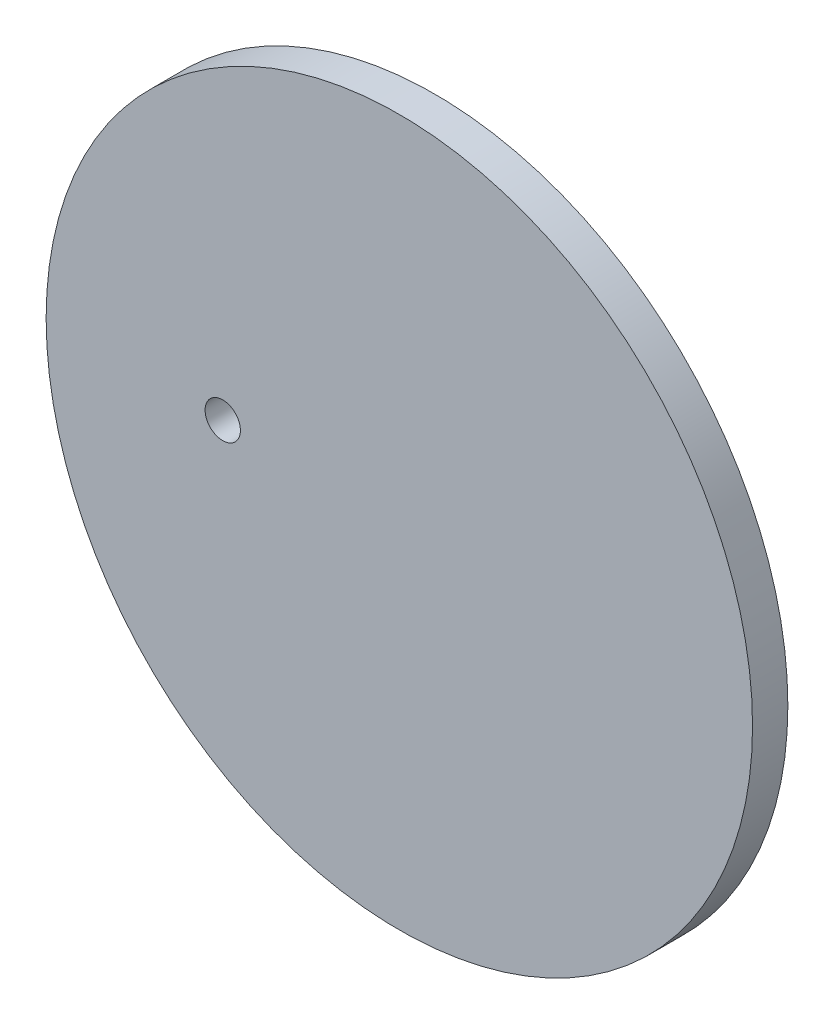
ISO-10303-21;
HEADER;
FILE_DESCRIPTION(('STEP AP214'),'2;1');
FILE_NAME('part.step','',(''),(''),'','','');
FILE_SCHEMA(('AUTOMOTIVE_DESIGN { 1 0 10303 214 1 1 1 1 }'));
ENDSEC;
DATA;
#1=APPLICATION_CONTEXT('core data for automotive mechanical design processes');
#2=APPLICATION_PROTOCOL_DEFINITION('international standard','automotive_design',2000,#1);
#3=PRODUCT_CONTEXT('',#1,'mechanical');
#4=PRODUCT('Part','Part','',(#3));
#5=PRODUCT_RELATED_PRODUCT_CATEGORY('part','',(#4));
#6=PRODUCT_DEFINITION_FORMATION('','',#4);
#7=PRODUCT_DEFINITION_CONTEXT('part definition',#1,'design');
#8=PRODUCT_DEFINITION('design','',#6,#7);
#9=PRODUCT_DEFINITION_SHAPE('','',#8);
#10=(LENGTH_UNIT() NAMED_UNIT(*) SI_UNIT(.MILLI.,.METRE.));
#11=(NAMED_UNIT(*) PLANE_ANGLE_UNIT() SI_UNIT($,.RADIAN.));
#12=(NAMED_UNIT(*) SI_UNIT($,.STERADIAN.) SOLID_ANGLE_UNIT());
#13=UNCERTAINTY_MEASURE_WITH_UNIT(LENGTH_MEASURE(1.E-05),#10,'distance_accuracy_value','');
#14=(GEOMETRIC_REPRESENTATION_CONTEXT(3) GLOBAL_UNCERTAINTY_ASSIGNED_CONTEXT((#13)) GLOBAL_UNIT_ASSIGNED_CONTEXT((#10,
#11,#12)) REPRESENTATION_CONTEXT('',''));
#15=CARTESIAN_POINT('',(0.,0.,0.));
#16=DIRECTION('',(0.,0.,1.));
#17=DIRECTION('',(1.,0.,0.));
#18=AXIS2_PLACEMENT_3D('',#15,#16,#17);
#19=CARTESIAN_POINT('',(0.,0.,2.));
#20=DIRECTION('',(0.,0.,1.));
#21=DIRECTION('',(1.,0.,0.));
#22=AXIS2_PLACEMENT_3D('',#19,#20,#21);
#23=PLANE('',#22);
#24=CARTESIAN_POINT('',(0.,0.,2.));
#25=DIRECTION('',(0.,0.,1.));
#26=DIRECTION('',(1.,0.,0.));
#27=AXIS2_PLACEMENT_3D('',#24,#25,#26);
#28=CIRCLE('',#27,40.);
#29=CARTESIAN_POINT('',(40.,0.,2.));
#30=VERTEX_POINT('',#29);
#31=EDGE_CURVE('E10',#30,#30,#28,.T.);
#32=ORIENTED_EDGE('',*,*,#31,.T.);
#33=EDGE_LOOP('',(#32));
#34=FACE_BOUND('',#33,.T.);
#35=CARTESIAN_POINT('',(-20.,0.,2.));
#36=DIRECTION('',(0.,0.,1.));
#37=DIRECTION('',(1.,0.,0.));
#38=AXIS2_PLACEMENT_3D('',#35,#36,#37);
#39=CIRCLE('',#38,2.);
#40=CARTESIAN_POINT('',(-18.,0.,2.));
#41=VERTEX_POINT('',#40);
#42=EDGE_CURVE('E40',#41,#41,#39,.T.);
#43=ORIENTED_EDGE('',*,*,#42,.F.);
#44=EDGE_LOOP('',(#43));
#45=FACE_BOUND('',#44,.T.);
#46=ADVANCED_FACE('F29',(#34,#45),#23,.T.);
#47=CARTESIAN_POINT('',(0.,0.,-2.));
#48=DIRECTION('',(0.,0.,1.));
#49=DIRECTION('',(1.,0.,0.));
#50=AXIS2_PLACEMENT_3D('',#47,#48,#49);
#51=PLANE('',#50);
#52=CARTESIAN_POINT('',(0.,0.,-2.));
#53=DIRECTION('',(0.,0.,1.));
#54=DIRECTION('',(1.,0.,0.));
#55=AXIS2_PLACEMENT_3D('',#52,#53,#54);
#56=CIRCLE('',#55,40.);
#57=CARTESIAN_POINT('',(40.,0.,-2.));
#58=VERTEX_POINT('',#57);
#59=EDGE_CURVE('E33',#58,#58,#56,.T.);
#60=ORIENTED_EDGE('',*,*,#59,.F.);
#61=EDGE_LOOP('',(#60));
#62=FACE_BOUND('',#61,.T.);
#63=CARTESIAN_POINT('',(-20.,0.,-2.));
#64=DIRECTION('',(0.,0.,1.));
#65=DIRECTION('',(1.,0.,0.));
#66=AXIS2_PLACEMENT_3D('',#63,#64,#65);
#67=CIRCLE('',#66,2.);
#68=CARTESIAN_POINT('',(-18.,0.,-2.));
#69=VERTEX_POINT('',#68);
#70=EDGE_CURVE('E42',#69,#69,#67,.T.);
#71=ORIENTED_EDGE('',*,*,#70,.T.);
#72=EDGE_LOOP('',(#71));
#73=FACE_BOUND('',#72,.T.);
#74=ADVANCED_FACE('F52',(#62,#73),#51,.F.);
#75=CARTESIAN_POINT('',(0.,0.,2.));
#76=DIRECTION('',(0.,0.,-1.));
#77=DIRECTION('',(-1.,0.,0.));
#78=AXIS2_PLACEMENT_3D('',#75,#76,#77);
#79=CYLINDRICAL_SURFACE('',#78,40.);
#80=ORIENTED_EDGE('',*,*,#31,.F.);
#81=EDGE_LOOP('',(#80));
#82=FACE_BOUND('',#81,.T.);
#83=ORIENTED_EDGE('',*,*,#59,.T.);
#84=EDGE_LOOP('',(#83));
#85=FACE_BOUND('',#84,.T.);
#86=ADVANCED_FACE('F31',(#82,#85),#79,.T.);
#87=CARTESIAN_POINT('',(-20.,0.,2.));
#88=DIRECTION('',(0.,0.,-1.));
#89=DIRECTION('',(-1.,0.,0.));
#90=AXIS2_PLACEMENT_3D('',#87,#88,#89);
#91=CYLINDRICAL_SURFACE('',#90,2.);
#92=ORIENTED_EDGE('',*,*,#42,.T.);
#93=EDGE_LOOP('',(#92));
#94=FACE_BOUND('',#93,.T.);
#95=ORIENTED_EDGE('',*,*,#70,.F.);
#96=EDGE_LOOP('',(#95));
#97=FACE_BOUND('',#96,.T.);
#98=ADVANCED_FACE('F48',(#94,#97),#91,.F.);
#99=CLOSED_SHELL('',(#46,#74,#86,#98));
#100=MANIFOLD_SOLID_BREP('B2',#99);
#101=ADVANCED_BREP_SHAPE_REPRESENTATION('',(#18,#100),#14);
#102=SHAPE_DEFINITION_REPRESENTATION(#9,#101);
ENDSEC;
END-ISO-10303-21;
